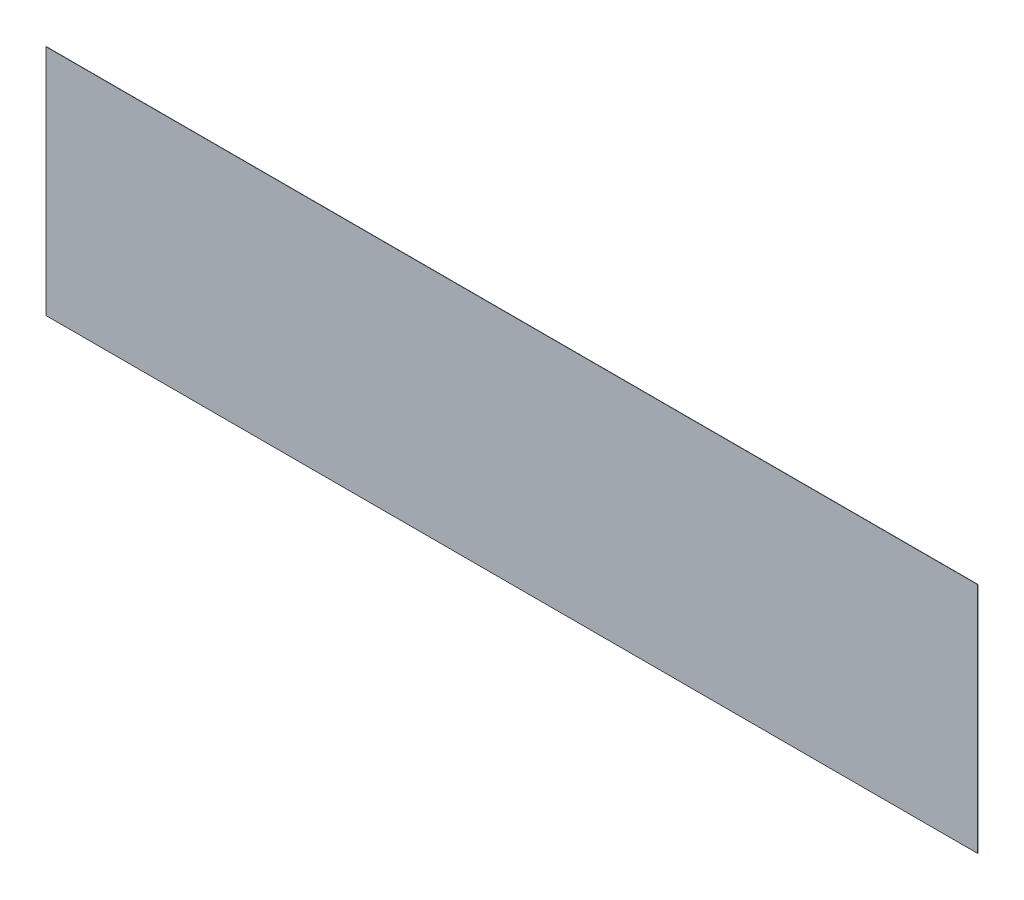
ISO-10303-21;
HEADER;
FILE_DESCRIPTION(('STEP AP214'),'2;1');
FILE_NAME('part.step','',(''),(''),'','','');
FILE_SCHEMA(('AUTOMOTIVE_DESIGN { 1 0 10303 214 1 1 1 1 }'));
ENDSEC;
DATA;
#1=APPLICATION_CONTEXT('core data for automotive mechanical design processes');
#2=APPLICATION_PROTOCOL_DEFINITION('international standard','automotive_design',2000,#1);
#3=PRODUCT_CONTEXT('',#1,'mechanical');
#4=PRODUCT('Part','Part','',(#3));
#5=PRODUCT_RELATED_PRODUCT_CATEGORY('part','',(#4));
#6=PRODUCT_DEFINITION_FORMATION('','',#4);
#7=PRODUCT_DEFINITION_CONTEXT('part definition',#1,'design');
#8=PRODUCT_DEFINITION('design','',#6,#7);
#9=PRODUCT_DEFINITION_SHAPE('','',#8);
#10=(LENGTH_UNIT() NAMED_UNIT(*) SI_UNIT(.MILLI.,.METRE.));
#11=(NAMED_UNIT(*) PLANE_ANGLE_UNIT() SI_UNIT($,.RADIAN.));
#12=(NAMED_UNIT(*) SI_UNIT($,.STERADIAN.) SOLID_ANGLE_UNIT());
#13=UNCERTAINTY_MEASURE_WITH_UNIT(LENGTH_MEASURE(1.E-05),#10,'distance_accuracy_value','');
#14=(GEOMETRIC_REPRESENTATION_CONTEXT(3) GLOBAL_UNCERTAINTY_ASSIGNED_CONTEXT((#13)) GLOBAL_UNIT_ASSIGNED_CONTEXT((#10,
#11,#12)) REPRESENTATION_CONTEXT('',''));
#15=CARTESIAN_POINT('',(0.,0.,0.));
#16=DIRECTION('',(0.,0.,1.));
#17=DIRECTION('',(1.,0.,0.));
#18=AXIS2_PLACEMENT_3D('',#15,#16,#17);
#19=CARTESIAN_POINT('',(-344.551,86.106,0.1016));
#20=DIRECTION('',(1.,0.,0.));
#21=DIRECTION('',(0.,0.,-1.));
#22=AXIS2_PLACEMENT_3D('',#19,#20,#21);
#23=PLANE('',#22);
#24=DIRECTION('',(0.,-1.,0.));
#25=VECTOR('',#24,1.);
#26=CARTESIAN_POINT('',(-344.551,86.106,-0.1016));
#27=LINE('',#26,#25);
#28=CARTESIAN_POINT('',(-344.551,86.106,-0.1016));
#29=VERTEX_POINT('',#28);
#30=CARTESIAN_POINT('',(-344.551,-86.1060000000001,-0.1016));
#31=VERTEX_POINT('',#30);
#32=EDGE_CURVE('E96',#29,#31,#27,.T.);
#33=ORIENTED_EDGE('',*,*,#32,.T.);
#34=DIRECTION('',(0.,0.,-1.));
#35=VECTOR('',#34,1.);
#36=CARTESIAN_POINT('',(-344.551,-86.1060000000001,0.1016));
#37=LINE('',#36,#35);
#38=CARTESIAN_POINT('',(-344.551,-86.1060000000001,0.1016));
#39=VERTEX_POINT('',#38);
#40=EDGE_CURVE('E11',#39,#31,#37,.T.);
#41=ORIENTED_EDGE('',*,*,#40,.F.);
#42=DIRECTION('',(0.,-1.,0.));
#43=VECTOR('',#42,1.);
#44=CARTESIAN_POINT('',(-344.551,86.106,0.1016));
#45=LINE('',#44,#43);
#46=CARTESIAN_POINT('',(-344.551,86.106,0.1016));
#47=VERTEX_POINT('',#46);
#48=EDGE_CURVE('E84',#47,#39,#45,.T.);
#49=ORIENTED_EDGE('',*,*,#48,.F.);
#50=DIRECTION('',(0.,0.,-1.));
#51=VECTOR('',#50,1.);
#52=CARTESIAN_POINT('',(-344.551,86.106,0.1016));
#53=LINE('',#52,#51);
#54=EDGE_CURVE('E92',#47,#29,#53,.T.);
#55=ORIENTED_EDGE('',*,*,#54,.T.);
#56=EDGE_LOOP('',(#33,#41,#49,#55));
#57=FACE_BOUND('',#56,.T.);
#58=ADVANCED_FACE('F33',(#57),#23,.F.);
#59=CARTESIAN_POINT('',(344.551,-86.106,0.1016));
#60=DIRECTION('',(0.,1.,0.));
#61=DIRECTION('',(-1.,0.,0.));
#62=AXIS2_PLACEMENT_3D('',#59,#60,#61);
#63=PLANE('',#62);
#64=DIRECTION('',(1.,0.,0.));
#65=VECTOR('',#64,1.);
#66=CARTESIAN_POINT('',(344.551,-86.106,-0.1016));
#67=LINE('',#66,#65);
#68=CARTESIAN_POINT('',(344.551,-86.106,-0.1016));
#69=VERTEX_POINT('',#68);
#70=EDGE_CURVE('E88',#31,#69,#67,.T.);
#71=ORIENTED_EDGE('',*,*,#70,.T.);
#72=DIRECTION('',(0.,0.,-1.));
#73=VECTOR('',#72,1.);
#74=CARTESIAN_POINT('',(344.551,-86.106,0.1016));
#75=LINE('',#74,#73);
#76=CARTESIAN_POINT('',(344.551,-86.106,0.1016));
#77=VERTEX_POINT('',#76);
#78=EDGE_CURVE('E41',#77,#69,#75,.T.);
#79=ORIENTED_EDGE('',*,*,#78,.F.);
#80=DIRECTION('',(1.,0.,0.));
#81=VECTOR('',#80,1.);
#82=CARTESIAN_POINT('',(344.551,-86.106,0.1016));
#83=LINE('',#82,#81);
#84=EDGE_CURVE('E79',#39,#77,#83,.T.);
#85=ORIENTED_EDGE('',*,*,#84,.F.);
#86=ORIENTED_EDGE('',*,*,#40,.T.);
#87=EDGE_LOOP('',(#71,#79,#85,#86));
#88=FACE_BOUND('',#87,.T.);
#89=ADVANCED_FACE('F87',(#88),#63,.F.);
#90=CARTESIAN_POINT('',(344.551,86.106,0.1016));
#91=DIRECTION('',(-1.,0.,0.));
#92=DIRECTION('',(0.,0.,1.));
#93=AXIS2_PLACEMENT_3D('',#90,#91,#92);
#94=PLANE('',#93);
#95=DIRECTION('',(0.,1.,0.));
#96=VECTOR('',#95,1.);
#97=CARTESIAN_POINT('',(344.551,86.106,-0.1016));
#98=LINE('',#97,#96);
#99=CARTESIAN_POINT('',(344.551,86.106,-0.1016));
#100=VERTEX_POINT('',#99);
#101=EDGE_CURVE('E66',#69,#100,#98,.T.);
#102=ORIENTED_EDGE('',*,*,#101,.T.);
#103=DIRECTION('',(0.,0.,-1.));
#104=VECTOR('',#103,1.);
#105=CARTESIAN_POINT('',(344.551,86.106,0.1016));
#106=LINE('',#105,#104);
#107=CARTESIAN_POINT('',(344.551,86.106,0.1016));
#108=VERTEX_POINT('',#107);
#109=EDGE_CURVE('E89',#108,#100,#106,.T.);
#110=ORIENTED_EDGE('',*,*,#109,.F.);
#111=DIRECTION('',(0.,1.,0.));
#112=VECTOR('',#111,1.);
#113=CARTESIAN_POINT('',(344.551,86.106,0.1016));
#114=LINE('',#113,#112);
#115=EDGE_CURVE('E82',#77,#108,#114,.T.);
#116=ORIENTED_EDGE('',*,*,#115,.F.);
#117=ORIENTED_EDGE('',*,*,#78,.T.);
#118=EDGE_LOOP('',(#102,#110,#116,#117));
#119=FACE_BOUND('',#118,.T.);
#120=ADVANCED_FACE('F90',(#119),#94,.F.);
#121=CARTESIAN_POINT('',(344.551,86.106,0.1016));
#122=DIRECTION('',(0.,-1.,0.));
#123=DIRECTION('',(1.,0.,0.));
#124=AXIS2_PLACEMENT_3D('',#121,#122,#123);
#125=PLANE('',#124);
#126=DIRECTION('',(-1.,0.,0.));
#127=VECTOR('',#126,1.);
#128=CARTESIAN_POINT('',(344.551,86.106,-0.1016));
#129=LINE('',#128,#127);
#130=EDGE_CURVE('E72',#100,#29,#129,.T.);
#131=ORIENTED_EDGE('',*,*,#130,.T.);
#132=ORIENTED_EDGE('',*,*,#54,.F.);
#133=DIRECTION('',(-1.,0.,0.));
#134=VECTOR('',#133,1.);
#135=CARTESIAN_POINT('',(344.551,86.106,0.1016));
#136=LINE('',#135,#134);
#137=EDGE_CURVE('E49',#108,#47,#136,.T.);
#138=ORIENTED_EDGE('',*,*,#137,.F.);
#139=ORIENTED_EDGE('',*,*,#109,.T.);
#140=EDGE_LOOP('',(#131,#132,#138,#139));
#141=FACE_BOUND('',#140,.T.);
#142=ADVANCED_FACE('F103',(#141),#125,.F.);
#143=CARTESIAN_POINT('',(0.,0.,0.1016));
#144=DIRECTION('',(0.,0.,-1.));
#145=DIRECTION('',(-1.,0.,0.));
#146=AXIS2_PLACEMENT_3D('',#143,#144,#145);
#147=PLANE('',#146);
#148=ORIENTED_EDGE('',*,*,#48,.T.);
#149=ORIENTED_EDGE('',*,*,#84,.T.);
#150=ORIENTED_EDGE('',*,*,#115,.T.);
#151=ORIENTED_EDGE('',*,*,#137,.T.);
#152=EDGE_LOOP('',(#148,#149,#150,#151));
#153=FACE_BOUND('',#152,.T.);
#154=ADVANCED_FACE('F80',(#153),#147,.F.);
#155=CARTESIAN_POINT('',(0.,0.,-0.1016));
#156=DIRECTION('',(0.,0.,-1.));
#157=DIRECTION('',(-1.,0.,0.));
#158=AXIS2_PLACEMENT_3D('',#155,#156,#157);
#159=PLANE('',#158);
#160=ORIENTED_EDGE('',*,*,#32,.F.);
#161=ORIENTED_EDGE('',*,*,#130,.F.);
#162=ORIENTED_EDGE('',*,*,#101,.F.);
#163=ORIENTED_EDGE('',*,*,#70,.F.);
#164=EDGE_LOOP('',(#160,#161,#162,#163));
#165=FACE_BOUND('',#164,.T.);
#166=ADVANCED_FACE('F106',(#165),#159,.T.);
#167=CLOSED_SHELL('',(#58,#89,#120,#142,#154,#166));
#168=MANIFOLD_SOLID_BREP('B2',#167);
#169=ADVANCED_BREP_SHAPE_REPRESENTATION('',(#18,#168),#14);
#170=SHAPE_DEFINITION_REPRESENTATION(#9,#169);
ENDSEC;
END-ISO-10303-21;
